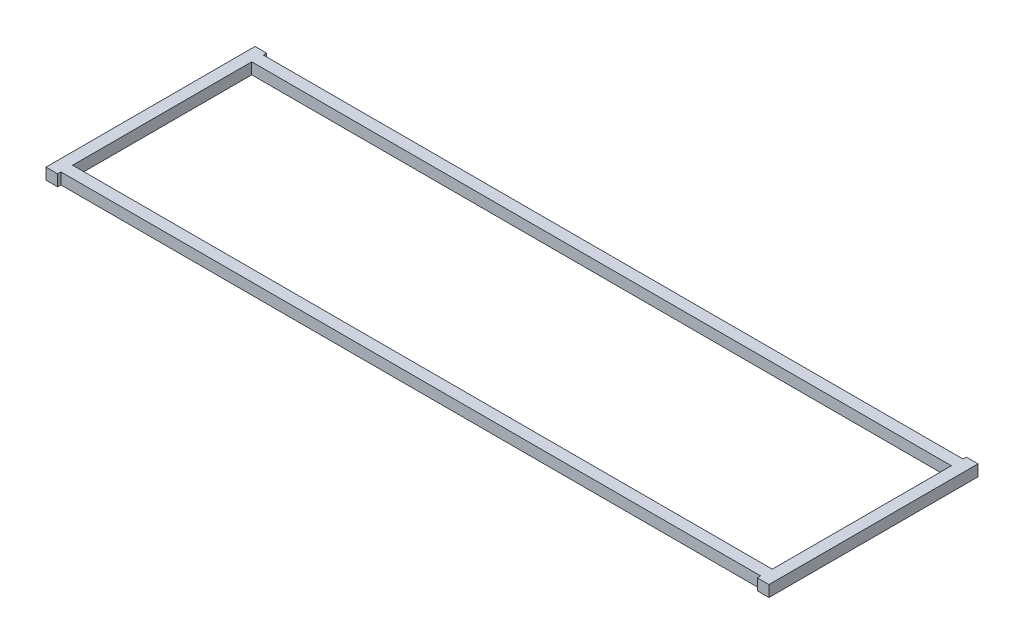
ISO-10303-21;
HEADER;
FILE_DESCRIPTION(('STEP AP214'),'2;1');
FILE_NAME('part.step','',(''),(''),'','','');
FILE_SCHEMA(('AUTOMOTIVE_DESIGN { 1 0 10303 214 1 1 1 1 }'));
ENDSEC;
DATA;
#1=APPLICATION_CONTEXT('core data for automotive mechanical design processes');
#2=APPLICATION_PROTOCOL_DEFINITION('international standard','automotive_design',2000,#1);
#3=PRODUCT_CONTEXT('',#1,'mechanical');
#4=PRODUCT('Part','Part','',(#3));
#5=PRODUCT_RELATED_PRODUCT_CATEGORY('part','',(#4));
#6=PRODUCT_DEFINITION_FORMATION('','',#4);
#7=PRODUCT_DEFINITION_CONTEXT('part definition',#1,'design');
#8=PRODUCT_DEFINITION('design','',#6,#7);
#9=PRODUCT_DEFINITION_SHAPE('','',#8);
#10=(LENGTH_UNIT() NAMED_UNIT(*) SI_UNIT(.MILLI.,.METRE.));
#11=(NAMED_UNIT(*) PLANE_ANGLE_UNIT() SI_UNIT($,.RADIAN.));
#12=(NAMED_UNIT(*) SI_UNIT($,.STERADIAN.) SOLID_ANGLE_UNIT());
#13=UNCERTAINTY_MEASURE_WITH_UNIT(LENGTH_MEASURE(1.E-05),#10,'distance_accuracy_value','');
#14=(GEOMETRIC_REPRESENTATION_CONTEXT(3) GLOBAL_UNCERTAINTY_ASSIGNED_CONTEXT((#13)) GLOBAL_UNIT_ASSIGNED_CONTEXT((#10,
#11,#12)) REPRESENTATION_CONTEXT('',''));
#15=CARTESIAN_POINT('',(0.,0.,0.));
#16=DIRECTION('',(0.,0.,1.));
#17=DIRECTION('',(1.,0.,0.));
#18=AXIS2_PLACEMENT_3D('',#15,#16,#17);
#19=CARTESIAN_POINT('',(196.7484,0.,56.9212476));
#20=DIRECTION('',(-1.,0.,0.));
#21=DIRECTION('',(0.,0.,1.));
#22=AXIS2_PLACEMENT_3D('',#19,#20,#21);
#23=PLANE('',#22);
#24=DIRECTION('',(0.,0.,1.));
#25=VECTOR('',#24,1.);
#26=CARTESIAN_POINT('',(196.7484,6.35,56.9212476));
#27=LINE('',#26,#25);
#28=CARTESIAN_POINT('',(196.7484,6.35,56.9212476));
#29=VERTEX_POINT('',#28);
#30=CARTESIAN_POINT('',(196.7484,6.35,58.785125));
#31=VERTEX_POINT('',#30);
#32=EDGE_CURVE('E196',#29,#31,#27,.T.);
#33=ORIENTED_EDGE('',*,*,#32,.F.);
#34=DIRECTION('',(0.,1.,0.));
#35=VECTOR('',#34,1.);
#36=CARTESIAN_POINT('',(196.7484,0.,56.9212476));
#37=LINE('',#36,#35);
#38=CARTESIAN_POINT('',(196.7484,0.,56.9212476));
#39=VERTEX_POINT('',#38);
#40=EDGE_CURVE('E11',#39,#29,#37,.T.);
#41=ORIENTED_EDGE('',*,*,#40,.F.);
#42=DIRECTION('',(0.,0.,1.));
#43=VECTOR('',#42,1.);
#44=CARTESIAN_POINT('',(196.7484,0.,56.9212476));
#45=LINE('',#44,#43);
#46=CARTESIAN_POINT('',(196.7484,0.,58.785125));
#47=VERTEX_POINT('',#46);
#48=EDGE_CURVE('E202',#39,#47,#45,.T.);
#49=ORIENTED_EDGE('',*,*,#48,.T.);
#50=DIRECTION('',(0.,1.,0.));
#51=VECTOR('',#50,1.);
#52=CARTESIAN_POINT('',(196.7484,0.,58.785125));
#53=LINE('',#52,#51);
#54=EDGE_CURVE('E43',#47,#31,#53,.T.);
#55=ORIENTED_EDGE('',*,*,#54,.T.);
#56=EDGE_LOOP('',(#33,#41,#49,#55));
#57=FACE_BOUND('',#56,.T.);
#58=ADVANCED_FACE('F39',(#57),#23,.T.);
#59=CARTESIAN_POINT('',(-196.7484,0.,56.9212476));
#60=DIRECTION('',(0.,0.,1.));
#61=DIRECTION('',(1.,0.,0.));
#62=AXIS2_PLACEMENT_3D('',#59,#60,#61);
#63=PLANE('',#62);
#64=DIRECTION('',(1.,0.,0.));
#65=VECTOR('',#64,1.);
#66=CARTESIAN_POINT('',(-196.7484,6.35,56.9212476));
#67=LINE('',#66,#65);
#68=CARTESIAN_POINT('',(-196.7484,6.35,56.9212476));
#69=VERTEX_POINT('',#68);
#70=EDGE_CURVE('E207',#69,#29,#67,.T.);
#71=ORIENTED_EDGE('',*,*,#70,.F.);
#72=DIRECTION('',(0.,1.,0.));
#73=VECTOR('',#72,1.);
#74=CARTESIAN_POINT('',(-196.7484,0.,56.9212476));
#75=LINE('',#74,#73);
#76=CARTESIAN_POINT('',(-196.7484,0.,56.9212476));
#77=VERTEX_POINT('',#76);
#78=EDGE_CURVE('E49',#77,#69,#75,.T.);
#79=ORIENTED_EDGE('',*,*,#78,.F.);
#80=DIRECTION('',(1.,0.,0.));
#81=VECTOR('',#80,1.);
#82=CARTESIAN_POINT('',(-196.7484,0.,56.9212476));
#83=LINE('',#82,#81);
#84=EDGE_CURVE('E247',#77,#39,#83,.T.);
#85=ORIENTED_EDGE('',*,*,#84,.T.);
#86=ORIENTED_EDGE('',*,*,#40,.T.);
#87=EDGE_LOOP('',(#71,#79,#85,#86));
#88=FACE_BOUND('',#87,.T.);
#89=ADVANCED_FACE('F338',(#88),#63,.T.);
#90=CARTESIAN_POINT('',(-196.7484,0.,58.785125));
#91=DIRECTION('',(1.,0.,0.));
#92=DIRECTION('',(0.,0.,-1.));
#93=AXIS2_PLACEMENT_3D('',#90,#91,#92);
#94=PLANE('',#93);
#95=DIRECTION('',(0.,0.,-1.));
#96=VECTOR('',#95,1.);
#97=CARTESIAN_POINT('',(-196.7484,6.35,58.785125));
#98=LINE('',#97,#96);
#99=CARTESIAN_POINT('',(-196.7484,6.35,58.785125));
#100=VERTEX_POINT('',#99);
#101=EDGE_CURVE('E290',#100,#69,#98,.T.);
#102=ORIENTED_EDGE('',*,*,#101,.F.);
#103=DIRECTION('',(0.,1.,0.));
#104=VECTOR('',#103,1.);
#105=CARTESIAN_POINT('',(-196.7484,0.,58.785125));
#106=LINE('',#105,#104);
#107=CARTESIAN_POINT('',(-196.7484,0.,58.785125));
#108=VERTEX_POINT('',#107);
#109=EDGE_CURVE('E299',#108,#100,#106,.T.);
#110=ORIENTED_EDGE('',*,*,#109,.F.);
#111=DIRECTION('',(0.,0.,-1.));
#112=VECTOR('',#111,1.);
#113=CARTESIAN_POINT('',(-196.7484,0.,58.785125));
#114=LINE('',#113,#112);
#115=EDGE_CURVE('E243',#108,#77,#114,.T.);
#116=ORIENTED_EDGE('',*,*,#115,.T.);
#117=ORIENTED_EDGE('',*,*,#78,.T.);
#118=EDGE_LOOP('',(#102,#110,#116,#117));
#119=FACE_BOUND('',#118,.T.);
#120=ADVANCED_FACE('F373',(#119),#94,.T.);
#121=CARTESIAN_POINT('',(-203.3016,0.,58.785125));
#122=DIRECTION('',(0.,0.,1.));
#123=DIRECTION('',(1.,0.,0.));
#124=AXIS2_PLACEMENT_3D('',#121,#122,#123);
#125=PLANE('',#124);
#126=DIRECTION('',(1.,0.,0.));
#127=VECTOR('',#126,1.);
#128=CARTESIAN_POINT('',(-203.3016,6.35,58.785125));
#129=LINE('',#128,#127);
#130=CARTESIAN_POINT('',(-203.3016,6.35,58.785125));
#131=VERTEX_POINT('',#130);
#132=EDGE_CURVE('E286',#131,#100,#129,.T.);
#133=ORIENTED_EDGE('',*,*,#132,.F.);
#134=DIRECTION('',(0.,1.,0.));
#135=VECTOR('',#134,1.);
#136=CARTESIAN_POINT('',(-203.3016,0.,58.785125));
#137=LINE('',#136,#135);
#138=CARTESIAN_POINT('',(-203.3016,0.,58.785125));
#139=VERTEX_POINT('',#138);
#140=EDGE_CURVE('E302',#139,#131,#137,.T.);
#141=ORIENTED_EDGE('',*,*,#140,.F.);
#142=DIRECTION('',(1.,0.,0.));
#143=VECTOR('',#142,1.);
#144=CARTESIAN_POINT('',(-203.3016,0.,58.785125));
#145=LINE('',#144,#143);
#146=EDGE_CURVE('E239',#139,#108,#145,.T.);
#147=ORIENTED_EDGE('',*,*,#146,.T.);
#148=ORIENTED_EDGE('',*,*,#109,.T.);
#149=EDGE_LOOP('',(#133,#141,#147,#148));
#150=FACE_BOUND('',#149,.T.);
#151=ADVANCED_FACE('F370',(#150),#125,.T.);
#152=CARTESIAN_POINT('',(-203.3016,0.,-58.785125));
#153=DIRECTION('',(-1.,0.,0.));
#154=DIRECTION('',(0.,0.,1.));
#155=AXIS2_PLACEMENT_3D('',#152,#153,#154);
#156=PLANE('',#155);
#157=DIRECTION('',(0.,0.,1.));
#158=VECTOR('',#157,1.);
#159=CARTESIAN_POINT('',(-203.3016,6.35,-58.785125));
#160=LINE('',#159,#158);
#161=CARTESIAN_POINT('',(-203.3016,6.35,-58.785125));
#162=VERTEX_POINT('',#161);
#163=EDGE_CURVE('E282',#162,#131,#160,.T.);
#164=ORIENTED_EDGE('',*,*,#163,.F.);
#165=DIRECTION('',(0.,1.,0.));
#166=VECTOR('',#165,1.);
#167=CARTESIAN_POINT('',(-203.3016,0.,-58.785125));
#168=LINE('',#167,#166);
#169=CARTESIAN_POINT('',(-203.3016,0.,-58.785125));
#170=VERTEX_POINT('',#169);
#171=EDGE_CURVE('E305',#170,#162,#168,.T.);
#172=ORIENTED_EDGE('',*,*,#171,.F.);
#173=DIRECTION('',(0.,0.,1.));
#174=VECTOR('',#173,1.);
#175=CARTESIAN_POINT('',(-203.3016,0.,-58.785125));
#176=LINE('',#175,#174);
#177=EDGE_CURVE('E235',#170,#139,#176,.T.);
#178=ORIENTED_EDGE('',*,*,#177,.T.);
#179=ORIENTED_EDGE('',*,*,#140,.T.);
#180=EDGE_LOOP('',(#164,#172,#178,#179));
#181=FACE_BOUND('',#180,.T.);
#182=ADVANCED_FACE('F367',(#181),#156,.T.);
#183=CARTESIAN_POINT('',(-196.7484,0.,-58.785125));
#184=DIRECTION('',(0.,0.,-1.));
#185=DIRECTION('',(-1.,0.,0.));
#186=AXIS2_PLACEMENT_3D('',#183,#184,#185);
#187=PLANE('',#186);
#188=DIRECTION('',(-1.,0.,0.));
#189=VECTOR('',#188,1.);
#190=CARTESIAN_POINT('',(-196.7484,6.35,-58.785125));
#191=LINE('',#190,#189);
#192=CARTESIAN_POINT('',(-196.7484,6.35,-58.785125));
#193=VERTEX_POINT('',#192);
#194=EDGE_CURVE('E278',#193,#162,#191,.T.);
#195=ORIENTED_EDGE('',*,*,#194,.F.);
#196=DIRECTION('',(0.,1.,0.));
#197=VECTOR('',#196,1.);
#198=CARTESIAN_POINT('',(-196.7484,0.,-58.785125));
#199=LINE('',#198,#197);
#200=CARTESIAN_POINT('',(-196.7484,0.,-58.785125));
#201=VERTEX_POINT('',#200);
#202=EDGE_CURVE('E308',#201,#193,#199,.T.);
#203=ORIENTED_EDGE('',*,*,#202,.F.);
#204=DIRECTION('',(-1.,0.,0.));
#205=VECTOR('',#204,1.);
#206=CARTESIAN_POINT('',(-196.7484,0.,-58.785125));
#207=LINE('',#206,#205);
#208=EDGE_CURVE('E231',#201,#170,#207,.T.);
#209=ORIENTED_EDGE('',*,*,#208,.T.);
#210=ORIENTED_EDGE('',*,*,#171,.T.);
#211=EDGE_LOOP('',(#195,#203,#209,#210));
#212=FACE_BOUND('',#211,.T.);
#213=ADVANCED_FACE('F363',(#212),#187,.T.);
#214=CARTESIAN_POINT('',(-196.7484,0.,-56.9212476));
#215=DIRECTION('',(1.,0.,0.));
#216=DIRECTION('',(0.,0.,-1.));
#217=AXIS2_PLACEMENT_3D('',#214,#215,#216);
#218=PLANE('',#217);
#219=DIRECTION('',(0.,0.,-1.));
#220=VECTOR('',#219,1.);
#221=CARTESIAN_POINT('',(-196.7484,6.35,-56.9212476));
#222=LINE('',#221,#220);
#223=CARTESIAN_POINT('',(-196.7484,6.35,-56.9212476));
#224=VERTEX_POINT('',#223);
#225=EDGE_CURVE('E274',#224,#193,#222,.T.);
#226=ORIENTED_EDGE('',*,*,#225,.F.);
#227=DIRECTION('',(0.,1.,0.));
#228=VECTOR('',#227,1.);
#229=CARTESIAN_POINT('',(-196.7484,0.,-56.9212476));
#230=LINE('',#229,#228);
#231=CARTESIAN_POINT('',(-196.7484,0.,-56.9212476));
#232=VERTEX_POINT('',#231);
#233=EDGE_CURVE('E311',#232,#224,#230,.T.);
#234=ORIENTED_EDGE('',*,*,#233,.F.);
#235=DIRECTION('',(0.,0.,-1.));
#236=VECTOR('',#235,1.);
#237=CARTESIAN_POINT('',(-196.7484,0.,-56.9212476));
#238=LINE('',#237,#236);
#239=EDGE_CURVE('E227',#232,#201,#238,.T.);
#240=ORIENTED_EDGE('',*,*,#239,.T.);
#241=ORIENTED_EDGE('',*,*,#202,.T.);
#242=EDGE_LOOP('',(#226,#234,#240,#241));
#243=FACE_BOUND('',#242,.T.);
#244=ADVANCED_FACE('F359',(#243),#218,.T.);
#245=CARTESIAN_POINT('',(196.7484,0.,-56.9212476));
#246=DIRECTION('',(0.,0.,-1.));
#247=DIRECTION('',(-1.,0.,0.));
#248=AXIS2_PLACEMENT_3D('',#245,#246,#247);
#249=PLANE('',#248);
#250=DIRECTION('',(-1.,0.,0.));
#251=VECTOR('',#250,1.);
#252=CARTESIAN_POINT('',(196.7484,6.35,-56.9212476));
#253=LINE('',#252,#251);
#254=CARTESIAN_POINT('',(196.7484,6.35,-56.9212476));
#255=VERTEX_POINT('',#254);
#256=EDGE_CURVE('E270',#255,#224,#253,.T.);
#257=ORIENTED_EDGE('',*,*,#256,.F.);
#258=DIRECTION('',(0.,1.,0.));
#259=VECTOR('',#258,1.);
#260=CARTESIAN_POINT('',(196.7484,0.,-56.9212476));
#261=LINE('',#260,#259);
#262=CARTESIAN_POINT('',(196.7484,0.,-56.9212476));
#263=VERTEX_POINT('',#262);
#264=EDGE_CURVE('E314',#263,#255,#261,.T.);
#265=ORIENTED_EDGE('',*,*,#264,.F.);
#266=DIRECTION('',(-1.,0.,0.));
#267=VECTOR('',#266,1.);
#268=CARTESIAN_POINT('',(196.7484,0.,-56.9212476));
#269=LINE('',#268,#267);
#270=EDGE_CURVE('E223',#263,#232,#269,.T.);
#271=ORIENTED_EDGE('',*,*,#270,.T.);
#272=ORIENTED_EDGE('',*,*,#233,.T.);
#273=EDGE_LOOP('',(#257,#265,#271,#272));
#274=FACE_BOUND('',#273,.T.);
#275=ADVANCED_FACE('F355',(#274),#249,.T.);
#276=CARTESIAN_POINT('',(196.7484,0.,-58.785125));
#277=DIRECTION('',(-1.,0.,0.));
#278=DIRECTION('',(0.,0.,1.));
#279=AXIS2_PLACEMENT_3D('',#276,#277,#278);
#280=PLANE('',#279);
#281=DIRECTION('',(0.,0.,1.));
#282=VECTOR('',#281,1.);
#283=CARTESIAN_POINT('',(196.7484,6.35,-58.785125));
#284=LINE('',#283,#282);
#285=CARTESIAN_POINT('',(196.7484,6.35,-58.785125));
#286=VERTEX_POINT('',#285);
#287=EDGE_CURVE('E266',#286,#255,#284,.T.);
#288=ORIENTED_EDGE('',*,*,#287,.F.);
#289=DIRECTION('',(0.,1.,0.));
#290=VECTOR('',#289,1.);
#291=CARTESIAN_POINT('',(196.7484,0.,-58.785125));
#292=LINE('',#291,#290);
#293=CARTESIAN_POINT('',(196.7484,0.,-58.785125));
#294=VERTEX_POINT('',#293);
#295=EDGE_CURVE('E317',#294,#286,#292,.T.);
#296=ORIENTED_EDGE('',*,*,#295,.F.);
#297=DIRECTION('',(0.,0.,1.));
#298=VECTOR('',#297,1.);
#299=CARTESIAN_POINT('',(196.7484,0.,-58.785125));
#300=LINE('',#299,#298);
#301=EDGE_CURVE('E219',#294,#263,#300,.T.);
#302=ORIENTED_EDGE('',*,*,#301,.T.);
#303=ORIENTED_EDGE('',*,*,#264,.T.);
#304=EDGE_LOOP('',(#288,#296,#302,#303));
#305=FACE_BOUND('',#304,.T.);
#306=ADVANCED_FACE('F351',(#305),#280,.T.);
#307=CARTESIAN_POINT('',(203.3016,0.,-58.785125));
#308=DIRECTION('',(0.,0.,-1.));
#309=DIRECTION('',(-1.,0.,0.));
#310=AXIS2_PLACEMENT_3D('',#307,#308,#309);
#311=PLANE('',#310);
#312=DIRECTION('',(-1.,0.,0.));
#313=VECTOR('',#312,1.);
#314=CARTESIAN_POINT('',(203.3016,6.35,-58.785125));
#315=LINE('',#314,#313);
#316=CARTESIAN_POINT('',(203.3016,6.35,-58.785125));
#317=VERTEX_POINT('',#316);
#318=EDGE_CURVE('E262',#317,#286,#315,.T.);
#319=ORIENTED_EDGE('',*,*,#318,.F.);
#320=DIRECTION('',(0.,1.,0.));
#321=VECTOR('',#320,1.);
#322=CARTESIAN_POINT('',(203.3016,0.,-58.785125));
#323=LINE('',#322,#321);
#324=CARTESIAN_POINT('',(203.3016,0.,-58.785125));
#325=VERTEX_POINT('',#324);
#326=EDGE_CURVE('E320',#325,#317,#323,.T.);
#327=ORIENTED_EDGE('',*,*,#326,.F.);
#328=DIRECTION('',(-1.,0.,0.));
#329=VECTOR('',#328,1.);
#330=CARTESIAN_POINT('',(203.3016,0.,-58.785125));
#331=LINE('',#330,#329);
#332=EDGE_CURVE('E215',#325,#294,#331,.T.);
#333=ORIENTED_EDGE('',*,*,#332,.T.);
#334=ORIENTED_EDGE('',*,*,#295,.T.);
#335=EDGE_LOOP('',(#319,#327,#333,#334));
#336=FACE_BOUND('',#335,.T.);
#337=ADVANCED_FACE('F349',(#336),#311,.T.);
#338=CARTESIAN_POINT('',(203.3016,0.,58.785125));
#339=DIRECTION('',(1.,0.,0.));
#340=DIRECTION('',(0.,0.,-1.));
#341=AXIS2_PLACEMENT_3D('',#338,#339,#340);
#342=PLANE('',#341);
#343=DIRECTION('',(0.,0.,-1.));
#344=VECTOR('',#343,1.);
#345=CARTESIAN_POINT('',(203.3016,6.35,58.785125));
#346=LINE('',#345,#344);
#347=CARTESIAN_POINT('',(203.3016,6.35,58.785125));
#348=VERTEX_POINT('',#347);
#349=EDGE_CURVE('E258',#348,#317,#346,.T.);
#350=ORIENTED_EDGE('',*,*,#349,.F.);
#351=DIRECTION('',(0.,1.,0.));
#352=VECTOR('',#351,1.);
#353=CARTESIAN_POINT('',(203.3016,0.,58.785125));
#354=LINE('',#353,#352);
#355=CARTESIAN_POINT('',(203.3016,0.,58.785125));
#356=VERTEX_POINT('',#355);
#357=EDGE_CURVE('E322',#356,#348,#354,.T.);
#358=ORIENTED_EDGE('',*,*,#357,.F.);
#359=DIRECTION('',(0.,0.,-1.));
#360=VECTOR('',#359,1.);
#361=CARTESIAN_POINT('',(203.3016,0.,58.785125));
#362=LINE('',#361,#360);
#363=EDGE_CURVE('E211',#356,#325,#362,.T.);
#364=ORIENTED_EDGE('',*,*,#363,.T.);
#365=ORIENTED_EDGE('',*,*,#326,.T.);
#366=EDGE_LOOP('',(#350,#358,#364,#365));
#367=FACE_BOUND('',#366,.T.);
#368=ADVANCED_FACE('F345',(#367),#342,.T.);
#369=CARTESIAN_POINT('',(196.7484,0.,58.785125));
#370=DIRECTION('',(0.,0.,1.));
#371=DIRECTION('',(1.,0.,0.));
#372=AXIS2_PLACEMENT_3D('',#369,#370,#371);
#373=PLANE('',#372);
#374=DIRECTION('',(1.,0.,0.));
#375=VECTOR('',#374,1.);
#376=CARTESIAN_POINT('',(196.7484,6.35,58.785125));
#377=LINE('',#376,#375);
#378=EDGE_CURVE('E254',#31,#348,#377,.T.);
#379=ORIENTED_EDGE('',*,*,#378,.F.);
#380=ORIENTED_EDGE('',*,*,#54,.F.);
#381=DIRECTION('',(1.,0.,0.));
#382=VECTOR('',#381,1.);
#383=CARTESIAN_POINT('',(196.7484,0.,58.785125));
#384=LINE('',#383,#382);
#385=EDGE_CURVE('E206',#47,#356,#384,.T.);
#386=ORIENTED_EDGE('',*,*,#385,.T.);
#387=ORIENTED_EDGE('',*,*,#357,.T.);
#388=EDGE_LOOP('',(#379,#380,#386,#387));
#389=FACE_BOUND('',#388,.T.);
#390=ADVANCED_FACE('F332',(#389),#373,.T.);
#391=CARTESIAN_POINT('',(0.,6.35,0.));
#392=DIRECTION('',(0.,-1.,0.));
#393=DIRECTION('',(0.,0.,-1.));
#394=AXIS2_PLACEMENT_3D('',#391,#392,#393);
#395=PLANE('',#394);
#396=DIRECTION('',(1.,0.,0.));
#397=VECTOR('',#396,1.);
#398=CARTESIAN_POINT('',(-196.7484,6.35,50.3680476));
#399=LINE('',#398,#397);
#400=CARTESIAN_POINT('',(-196.7484,6.35,50.3680476));
#401=VERTEX_POINT('',#400);
#402=CARTESIAN_POINT('',(196.7484,6.35,50.3680476));
#403=VERTEX_POINT('',#402);
#404=EDGE_CURVE('E65',#401,#403,#399,.T.);
#405=ORIENTED_EDGE('',*,*,#404,.F.);
#406=DIRECTION('',(0.,0.,1.));
#407=VECTOR('',#406,1.);
#408=CARTESIAN_POINT('',(-196.7484,6.35,-50.3680476));
#409=LINE('',#408,#407);
#410=CARTESIAN_POINT('',(-196.7484,6.35,-50.3680476));
#411=VERTEX_POINT('',#410);
#412=EDGE_CURVE('E174',#411,#401,#409,.T.);
#413=ORIENTED_EDGE('',*,*,#412,.F.);
#414=DIRECTION('',(-1.,0.,0.));
#415=VECTOR('',#414,1.);
#416=CARTESIAN_POINT('',(196.7484,6.35,-50.3680476));
#417=LINE('',#416,#415);
#418=CARTESIAN_POINT('',(196.7484,6.35,-50.3680476));
#419=VERTEX_POINT('',#418);
#420=EDGE_CURVE('E178',#419,#411,#417,.T.);
#421=ORIENTED_EDGE('',*,*,#420,.F.);
#422=DIRECTION('',(0.,0.,-1.));
#423=VECTOR('',#422,1.);
#424=CARTESIAN_POINT('',(196.7484,6.35,50.3680476));
#425=LINE('',#424,#423);
#426=EDGE_CURVE('E187',#403,#419,#425,.T.);
#427=ORIENTED_EDGE('',*,*,#426,.F.);
#428=EDGE_LOOP('',(#405,#413,#421,#427));
#429=FACE_BOUND('',#428,.T.);
#430=ORIENTED_EDGE('',*,*,#32,.T.);
#431=ORIENTED_EDGE('',*,*,#378,.T.);
#432=ORIENTED_EDGE('',*,*,#349,.T.);
#433=ORIENTED_EDGE('',*,*,#318,.T.);
#434=ORIENTED_EDGE('',*,*,#287,.T.);
#435=ORIENTED_EDGE('',*,*,#256,.T.);
#436=ORIENTED_EDGE('',*,*,#225,.T.);
#437=ORIENTED_EDGE('',*,*,#194,.T.);
#438=ORIENTED_EDGE('',*,*,#163,.T.);
#439=ORIENTED_EDGE('',*,*,#132,.T.);
#440=ORIENTED_EDGE('',*,*,#101,.T.);
#441=ORIENTED_EDGE('',*,*,#70,.T.);
#442=EDGE_LOOP('',(#430,#431,#432,#433,#434,#435,#436,#437,#438,#439,#440,#441));
#443=FACE_BOUND('',#442,.T.);
#444=ADVANCED_FACE('F334',(#429,#443),#395,.F.);
#445=CARTESIAN_POINT('',(0.,0.,0.));
#446=DIRECTION('',(0.,-1.,0.));
#447=DIRECTION('',(0.,0.,-1.));
#448=AXIS2_PLACEMENT_3D('',#445,#446,#447);
#449=PLANE('',#448);
#450=DIRECTION('',(0.,0.,1.));
#451=VECTOR('',#450,1.);
#452=CARTESIAN_POINT('',(-196.7484,0.,-50.3680476));
#453=LINE('',#452,#451);
#454=CARTESIAN_POINT('',(-196.7484,0.,-50.3680476));
#455=VERTEX_POINT('',#454);
#456=CARTESIAN_POINT('',(-196.7484,0.,50.3680476));
#457=VERTEX_POINT('',#456);
#458=EDGE_CURVE('E163',#455,#457,#453,.T.);
#459=ORIENTED_EDGE('',*,*,#458,.T.);
#460=DIRECTION('',(1.,0.,0.));
#461=VECTOR('',#460,1.);
#462=CARTESIAN_POINT('',(-196.7484,0.,50.3680476));
#463=LINE('',#462,#461);
#464=CARTESIAN_POINT('',(196.7484,0.,50.3680476));
#465=VERTEX_POINT('',#464);
#466=EDGE_CURVE('E156',#457,#465,#463,.T.);
#467=ORIENTED_EDGE('',*,*,#466,.T.);
#468=DIRECTION('',(0.,0.,-1.));
#469=VECTOR('',#468,1.);
#470=CARTESIAN_POINT('',(196.7484,0.,50.3680476));
#471=LINE('',#470,#469);
#472=CARTESIAN_POINT('',(196.7484,0.,-50.3680476));
#473=VERTEX_POINT('',#472);
#474=EDGE_CURVE('E166',#465,#473,#471,.T.);
#475=ORIENTED_EDGE('',*,*,#474,.T.);
#476=DIRECTION('',(-1.,0.,0.));
#477=VECTOR('',#476,1.);
#478=CARTESIAN_POINT('',(196.7484,0.,-50.3680476));
#479=LINE('',#478,#477);
#480=EDGE_CURVE('E57',#473,#455,#479,.T.);
#481=ORIENTED_EDGE('',*,*,#480,.T.);
#482=EDGE_LOOP('',(#459,#467,#475,#481));
#483=FACE_BOUND('',#482,.T.);
#484=ORIENTED_EDGE('',*,*,#48,.F.);
#485=ORIENTED_EDGE('',*,*,#84,.F.);
#486=ORIENTED_EDGE('',*,*,#115,.F.);
#487=ORIENTED_EDGE('',*,*,#146,.F.);
#488=ORIENTED_EDGE('',*,*,#177,.F.);
#489=ORIENTED_EDGE('',*,*,#208,.F.);
#490=ORIENTED_EDGE('',*,*,#239,.F.);
#491=ORIENTED_EDGE('',*,*,#270,.F.);
#492=ORIENTED_EDGE('',*,*,#301,.F.);
#493=ORIENTED_EDGE('',*,*,#332,.F.);
#494=ORIENTED_EDGE('',*,*,#363,.F.);
#495=ORIENTED_EDGE('',*,*,#385,.F.);
#496=EDGE_LOOP('',(#484,#485,#486,#487,#488,#489,#490,#491,#492,#493,#494,#495));
#497=FACE_BOUND('',#496,.T.);
#498=ADVANCED_FACE('F41',(#483,#497),#449,.T.);
#499=CARTESIAN_POINT('',(196.7484,0.,50.3680476));
#500=DIRECTION('',(1.,0.,0.));
#501=DIRECTION('',(0.,0.,-1.));
#502=AXIS2_PLACEMENT_3D('',#499,#500,#501);
#503=PLANE('',#502);
#504=ORIENTED_EDGE('',*,*,#426,.T.);
#505=DIRECTION('',(0.,1.,0.));
#506=VECTOR('',#505,1.);
#507=CARTESIAN_POINT('',(196.7484,0.,-50.3680476));
#508=LINE('',#507,#506);
#509=EDGE_CURVE('E162',#473,#419,#508,.T.);
#510=ORIENTED_EDGE('',*,*,#509,.F.);
#511=ORIENTED_EDGE('',*,*,#474,.F.);
#512=DIRECTION('',(0.,1.,0.));
#513=VECTOR('',#512,1.);
#514=CARTESIAN_POINT('',(196.7484,0.,50.3680476));
#515=LINE('',#514,#513);
#516=EDGE_CURVE('E152',#465,#403,#515,.T.);
#517=ORIENTED_EDGE('',*,*,#516,.T.);
#518=EDGE_LOOP('',(#504,#510,#511,#517));
#519=FACE_BOUND('',#518,.T.);
#520=ADVANCED_FACE('F167',(#519),#503,.F.);
#521=CARTESIAN_POINT('',(196.7484,0.,-50.3680476));
#522=DIRECTION('',(0.,0.,-1.));
#523=DIRECTION('',(-1.,0.,0.));
#524=AXIS2_PLACEMENT_3D('',#521,#522,#523);
#525=PLANE('',#524);
#526=ORIENTED_EDGE('',*,*,#420,.T.);
#527=DIRECTION('',(0.,1.,0.));
#528=VECTOR('',#527,1.);
#529=CARTESIAN_POINT('',(-196.7484,0.,-50.3680476));
#530=LINE('',#529,#528);
#531=EDGE_CURVE('E197',#455,#411,#530,.T.);
#532=ORIENTED_EDGE('',*,*,#531,.F.);
#533=ORIENTED_EDGE('',*,*,#480,.F.);
#534=ORIENTED_EDGE('',*,*,#509,.T.);
#535=EDGE_LOOP('',(#526,#532,#533,#534));
#536=FACE_BOUND('',#535,.T.);
#537=ADVANCED_FACE('F396',(#536),#525,.F.);
#538=CARTESIAN_POINT('',(-196.7484,0.,-50.3680476));
#539=DIRECTION('',(-1.,0.,0.));
#540=DIRECTION('',(0.,0.,1.));
#541=AXIS2_PLACEMENT_3D('',#538,#539,#540);
#542=PLANE('',#541);
#543=ORIENTED_EDGE('',*,*,#412,.T.);
#544=DIRECTION('',(0.,1.,0.));
#545=VECTOR('',#544,1.);
#546=CARTESIAN_POINT('',(-196.7484,0.,50.3680476));
#547=LINE('',#546,#545);
#548=EDGE_CURVE('E193',#457,#401,#547,.T.);
#549=ORIENTED_EDGE('',*,*,#548,.F.);
#550=ORIENTED_EDGE('',*,*,#458,.F.);
#551=ORIENTED_EDGE('',*,*,#531,.T.);
#552=EDGE_LOOP('',(#543,#549,#550,#551));
#553=FACE_BOUND('',#552,.T.);
#554=ADVANCED_FACE('F398',(#553),#542,.F.);
#555=CARTESIAN_POINT('',(-196.7484,0.,50.3680476));
#556=DIRECTION('',(0.,0.,1.));
#557=DIRECTION('',(1.,0.,0.));
#558=AXIS2_PLACEMENT_3D('',#555,#556,#557);
#559=PLANE('',#558);
#560=ORIENTED_EDGE('',*,*,#404,.T.);
#561=ORIENTED_EDGE('',*,*,#516,.F.);
#562=ORIENTED_EDGE('',*,*,#466,.F.);
#563=ORIENTED_EDGE('',*,*,#548,.T.);
#564=EDGE_LOOP('',(#560,#561,#562,#563));
#565=FACE_BOUND('',#564,.T.);
#566=ADVANCED_FACE('F154',(#565),#559,.F.);
#567=CLOSED_SHELL('',(#58,#89,#120,#151,#182,#213,#244,#275,#306,#337,#368,#390,#444,#498,#520,
#537,#554,#566));
#568=MANIFOLD_SOLID_BREP('B2',#567);
#569=ADVANCED_BREP_SHAPE_REPRESENTATION('',(#18,#568),#14);
#570=SHAPE_DEFINITION_REPRESENTATION(#9,#569);
ENDSEC;
END-ISO-10303-21;
